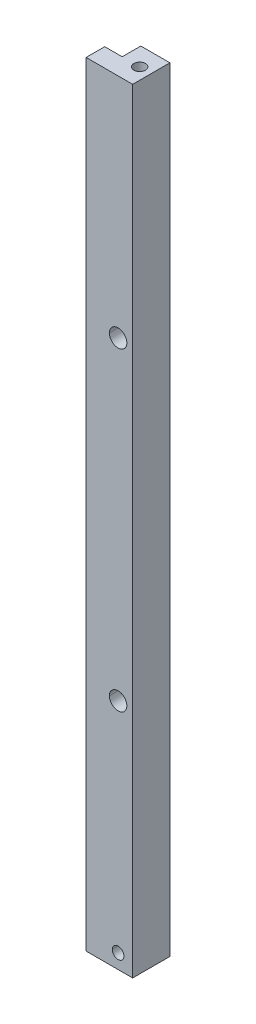
ISO-10303-21;
HEADER;
FILE_DESCRIPTION(('STEP AP214'),'2;1');
FILE_NAME('part.step','',(''),(''),'','','');
FILE_SCHEMA(('AUTOMOTIVE_DESIGN { 1 0 10303 214 1 1 1 1 }'));
ENDSEC;
DATA;
#1=APPLICATION_CONTEXT('core data for automotive mechanical design processes');
#2=APPLICATION_PROTOCOL_DEFINITION('international standard','automotive_design',2000,#1);
#3=PRODUCT_CONTEXT('',#1,'mechanical');
#4=PRODUCT('Part','Part','',(#3));
#5=PRODUCT_RELATED_PRODUCT_CATEGORY('part','',(#4));
#6=PRODUCT_DEFINITION_FORMATION('','',#4);
#7=PRODUCT_DEFINITION_CONTEXT('part definition',#1,'design');
#8=PRODUCT_DEFINITION('design','',#6,#7);
#9=PRODUCT_DEFINITION_SHAPE('','',#8);
#10=(LENGTH_UNIT() NAMED_UNIT(*) SI_UNIT(.MILLI.,.METRE.));
#11=(NAMED_UNIT(*) PLANE_ANGLE_UNIT() SI_UNIT($,.RADIAN.));
#12=(NAMED_UNIT(*) SI_UNIT($,.STERADIAN.) SOLID_ANGLE_UNIT());
#13=UNCERTAINTY_MEASURE_WITH_UNIT(LENGTH_MEASURE(1.E-05),#10,'distance_accuracy_value','');
#14=(GEOMETRIC_REPRESENTATION_CONTEXT(3) GLOBAL_UNCERTAINTY_ASSIGNED_CONTEXT((#13)) GLOBAL_UNIT_ASSIGNED_CONTEXT((#10,
#11,#12)) REPRESENTATION_CONTEXT('',''));
#15=CARTESIAN_POINT('',(0.,0.,0.));
#16=DIRECTION('',(0.,0.,1.));
#17=DIRECTION('',(1.,0.,0.));
#18=AXIS2_PLACEMENT_3D('',#15,#16,#17);
#19=CARTESIAN_POINT('',(0.,0.,0.));
#20=DIRECTION('',(0.,1.,0.));
#21=DIRECTION('',(1.,0.,0.));
#22=AXIS2_PLACEMENT_3D('',#19,#20,#21);
#23=PLANE('',#22);
#24=CARTESIAN_POINT('',(3.,0.,-3.2));
#25=DIRECTION('',(0.,1.,0.));
#26=DIRECTION('',(-1.,0.,0.));
#27=AXIS2_PLACEMENT_3D('',#24,#25,#26);
#28=CIRCLE('',#27,1.);
#29=CARTESIAN_POINT('',(2.,0.,-3.2));
#30=VERTEX_POINT('',#29);
#31=CARTESIAN_POINT('',(4.,0.,-3.2));
#32=VERTEX_POINT('',#31);
#33=EDGE_CURVE('E168',#30,#32,#28,.T.);
#34=ORIENTED_EDGE('',*,*,#33,.F.);
#35=CARTESIAN_POINT('',(3.,0.,-3.2));
#36=DIRECTION('',(0.,1.,0.));
#37=DIRECTION('',(1.,0.,0.));
#38=AXIS2_PLACEMENT_3D('',#35,#36,#37);
#39=CIRCLE('',#38,1.);
#40=EDGE_CURVE('E70',#32,#30,#39,.T.);
#41=ORIENTED_EDGE('',*,*,#40,.F.);
#42=EDGE_LOOP('',(#34,#41));
#43=FACE_BOUND('',#42,.T.);
#44=DIRECTION('',(-1.,0.,0.));
#45=VECTOR('',#44,1.);
#46=CARTESIAN_POINT('',(0.,0.,-3.2));
#47=LINE('',#46,#45);
#48=CARTESIAN_POINT('',(0.,0.,-3.2));
#49=VERTEX_POINT('',#48);
#50=CARTESIAN_POINT('',(-3.,0.,-3.2));
#51=VERTEX_POINT('',#50);
#52=EDGE_CURVE('E12',#49,#51,#47,.T.);
#53=ORIENTED_EDGE('',*,*,#52,.T.);
#54=DIRECTION('',(0.,0.,1.));
#55=VECTOR('',#54,1.);
#56=CARTESIAN_POINT('',(-3.,0.,-3.2));
#57=LINE('',#56,#55);
#58=CARTESIAN_POINT('',(-3.,0.,0.));
#59=VERTEX_POINT('',#58);
#60=EDGE_CURVE('E61',#51,#59,#57,.T.);
#61=ORIENTED_EDGE('',*,*,#60,.T.);
#62=DIRECTION('',(1.,0.,0.));
#63=VECTOR('',#62,1.);
#64=CARTESIAN_POINT('',(-3.,0.,0.));
#65=LINE('',#64,#63);
#66=CARTESIAN_POINT('',(5.,0.,0.));
#67=VERTEX_POINT('',#66);
#68=EDGE_CURVE('E322',#59,#67,#65,.T.);
#69=ORIENTED_EDGE('',*,*,#68,.T.);
#70=DIRECTION('',(0.,0.,-1.));
#71=VECTOR('',#70,1.);
#72=CARTESIAN_POINT('',(5.,0.,0.));
#73=LINE('',#72,#71);
#74=CARTESIAN_POINT('',(5.,0.,-6.4));
#75=VERTEX_POINT('',#74);
#76=EDGE_CURVE('E318',#67,#75,#73,.T.);
#77=ORIENTED_EDGE('',*,*,#76,.T.);
#78=DIRECTION('',(-1.,0.,0.));
#79=VECTOR('',#78,1.);
#80=CARTESIAN_POINT('',(5.,0.,-6.4));
#81=LINE('',#80,#79);
#82=CARTESIAN_POINT('',(0.,0.,-6.4));
#83=VERTEX_POINT('',#82);
#84=EDGE_CURVE('E190',#75,#83,#81,.T.);
#85=ORIENTED_EDGE('',*,*,#84,.T.);
#86=DIRECTION('',(0.,0.,1.));
#87=VECTOR('',#86,1.);
#88=CARTESIAN_POINT('',(0.,0.,-6.4));
#89=LINE('',#88,#87);
#90=EDGE_CURVE('E175',#83,#49,#89,.T.);
#91=ORIENTED_EDGE('',*,*,#90,.T.);
#92=EDGE_LOOP('',(#53,#61,#69,#77,#85,#91));
#93=FACE_BOUND('',#92,.T.);
#94=ADVANCED_FACE('F50',(#43,#93),#23,.T.);
#95=CARTESIAN_POINT('',(3.,-13.2309036499789,-3.2));
#96=DIRECTION('',(0.,-1.,0.));
#97=DIRECTION('',(1.,0.,0.));
#98=AXIS2_PLACEMENT_3D('',#95,#96,#97);
#99=CYLINDRICAL_SURFACE('',#98,1.);
#100=DIRECTION('',(0.,1.,0.));
#101=VECTOR('',#100,1.);
#102=CARTESIAN_POINT('',(4.,-12.,-3.2));
#103=LINE('',#102,#101);
#104=CARTESIAN_POINT('',(4.,-12.,-3.2));
#105=VERTEX_POINT('',#104);
#106=EDGE_CURVE('E151',#105,#32,#103,.T.);
#107=ORIENTED_EDGE('',*,*,#106,.F.);
#108=CARTESIAN_POINT('',(3.,-12.,-3.2));
#109=DIRECTION('',(0.,-1.,0.));
#110=DIRECTION('',(1.,0.,0.));
#111=AXIS2_PLACEMENT_3D('',#108,#109,#110);
#112=CIRCLE('',#111,1.);
#113=CARTESIAN_POINT('',(2.,-12.,-3.2));
#114=VERTEX_POINT('',#113);
#115=EDGE_CURVE('E166',#105,#114,#112,.T.);
#116=ORIENTED_EDGE('',*,*,#115,.T.);
#117=DIRECTION('',(0.,1.,0.));
#118=VECTOR('',#117,1.);
#119=CARTESIAN_POINT('',(2.,-12.,-3.2));
#120=LINE('',#119,#118);
#121=EDGE_CURVE('E153',#114,#30,#120,.T.);
#122=ORIENTED_EDGE('',*,*,#121,.T.);
#123=ORIENTED_EDGE('',*,*,#33,.T.);
#124=EDGE_LOOP('',(#107,#116,#122,#123));
#125=FACE_BOUND('',#124,.T.);
#126=ADVANCED_FACE('F165',(#125),#99,.F.);
#127=CARTESIAN_POINT('',(3.,-13.2309036499789,-3.2));
#128=DIRECTION('',(0.,-1.,0.));
#129=DIRECTION('',(1.,0.,0.));
#130=AXIS2_PLACEMENT_3D('',#127,#128,#129);
#131=CYLINDRICAL_SURFACE('',#130,1.);
#132=ORIENTED_EDGE('',*,*,#121,.F.);
#133=CARTESIAN_POINT('',(3.,-12.,-3.2));
#134=DIRECTION('',(0.,1.,0.));
#135=DIRECTION('',(1.,0.,0.));
#136=AXIS2_PLACEMENT_3D('',#133,#134,#135);
#137=CIRCLE('',#136,1.);
#138=EDGE_CURVE('E148',#105,#114,#137,.T.);
#139=ORIENTED_EDGE('',*,*,#138,.F.);
#140=ORIENTED_EDGE('',*,*,#106,.T.);
#141=ORIENTED_EDGE('',*,*,#40,.T.);
#142=EDGE_LOOP('',(#132,#139,#140,#141));
#143=FACE_BOUND('',#142,.T.);
#144=ADVANCED_FACE('F150',(#143),#131,.F.);
#145=CARTESIAN_POINT('',(0.,0.,-3.2));
#146=DIRECTION('',(0.,0.,-1.));
#147=DIRECTION('',(-1.,0.,0.));
#148=AXIS2_PLACEMENT_3D('',#145,#146,#147);
#149=PLANE('',#148);
#150=DIRECTION('',(0.,-1.,0.));
#151=VECTOR('',#150,1.);
#152=CARTESIAN_POINT('',(0.,0.,-3.2));
#153=LINE('',#152,#151);
#154=CARTESIAN_POINT('',(0.,-133.,-3.2));
#155=VERTEX_POINT('',#154);
#156=EDGE_CURVE('E202',#49,#155,#153,.T.);
#157=ORIENTED_EDGE('',*,*,#156,.T.);
#158=DIRECTION('',(-1.,0.,0.));
#159=VECTOR('',#158,1.);
#160=CARTESIAN_POINT('',(0.,-133.,-3.2));
#161=LINE('',#160,#159);
#162=CARTESIAN_POINT('',(-3.,-133.,-3.2));
#163=VERTEX_POINT('',#162);
#164=EDGE_CURVE('E221',#155,#163,#161,.T.);
#165=ORIENTED_EDGE('',*,*,#164,.T.);
#166=DIRECTION('',(0.,-1.,0.));
#167=VECTOR('',#166,1.);
#168=CARTESIAN_POINT('',(-3.,0.,-3.2));
#169=LINE('',#168,#167);
#170=EDGE_CURVE('E208',#51,#163,#169,.T.);
#171=ORIENTED_EDGE('',*,*,#170,.F.);
#172=ORIENTED_EDGE('',*,*,#52,.F.);
#173=EDGE_LOOP('',(#157,#165,#171,#172));
#174=FACE_BOUND('',#173,.T.);
#175=ADVANCED_FACE('F276',(#174),#149,.T.);
#176=CARTESIAN_POINT('',(-3.,0.,-3.2));
#177=DIRECTION('',(-1.,0.,0.));
#178=DIRECTION('',(0.,0.,1.));
#179=AXIS2_PLACEMENT_3D('',#176,#177,#178);
#180=PLANE('',#179);
#181=ORIENTED_EDGE('',*,*,#170,.T.);
#182=DIRECTION('',(0.,0.,1.));
#183=VECTOR('',#182,1.);
#184=CARTESIAN_POINT('',(-3.,-133.,-3.2));
#185=LINE('',#184,#183);
#186=CARTESIAN_POINT('',(-3.,-133.,0.));
#187=VERTEX_POINT('',#186);
#188=EDGE_CURVE('E204',#163,#187,#185,.T.);
#189=ORIENTED_EDGE('',*,*,#188,.T.);
#190=DIRECTION('',(0.,-1.,0.));
#191=VECTOR('',#190,1.);
#192=CARTESIAN_POINT('',(-3.,0.,0.));
#193=LINE('',#192,#191);
#194=EDGE_CURVE('E209',#59,#187,#193,.T.);
#195=ORIENTED_EDGE('',*,*,#194,.F.);
#196=ORIENTED_EDGE('',*,*,#60,.F.);
#197=EDGE_LOOP('',(#181,#189,#195,#196));
#198=FACE_BOUND('',#197,.T.);
#199=ADVANCED_FACE('F352',(#198),#180,.T.);
#200=CARTESIAN_POINT('',(-3.,0.,0.));
#201=DIRECTION('',(0.,0.,1.));
#202=DIRECTION('',(1.,0.,0.));
#203=AXIS2_PLACEMENT_3D('',#200,#201,#202);
#204=PLANE('',#203);
#205=CARTESIAN_POINT('',(2.5,-39.,0.));
#206=DIRECTION('',(0.,0.,1.));
#207=DIRECTION('',(-1.,0.,0.));
#208=AXIS2_PLACEMENT_3D('',#205,#206,#207);
#209=CIRCLE('',#208,1.5);
#210=CARTESIAN_POINT('',(1.,-39.,0.));
#211=VERTEX_POINT('',#210);
#212=CARTESIAN_POINT('',(4.,-39.,0.));
#213=VERTEX_POINT('',#212);
#214=EDGE_CURVE('E212',#211,#213,#209,.T.);
#215=ORIENTED_EDGE('',*,*,#214,.F.);
#216=CARTESIAN_POINT('',(2.5,-39.,0.));
#217=DIRECTION('',(0.,0.,1.));
#218=DIRECTION('',(1.,0.,0.));
#219=AXIS2_PLACEMENT_3D('',#216,#217,#218);
#220=CIRCLE('',#219,1.5);
#221=EDGE_CURVE('E226',#213,#211,#220,.T.);
#222=ORIENTED_EDGE('',*,*,#221,.F.);
#223=EDGE_LOOP('',(#215,#222));
#224=FACE_BOUND('',#223,.T.);
#225=CARTESIAN_POINT('',(2.5,-93.,0.));
#226=DIRECTION('',(0.,0.,1.));
#227=DIRECTION('',(-1.,0.,0.));
#228=AXIS2_PLACEMENT_3D('',#225,#226,#227);
#229=CIRCLE('',#228,1.5);
#230=CARTESIAN_POINT('',(1.,-93.,0.));
#231=VERTEX_POINT('',#230);
#232=CARTESIAN_POINT('',(4.,-93.,0.));
#233=VERTEX_POINT('',#232);
#234=EDGE_CURVE('E227',#231,#233,#229,.T.);
#235=ORIENTED_EDGE('',*,*,#234,.F.);
#236=CARTESIAN_POINT('',(2.5,-93.,0.));
#237=DIRECTION('',(0.,0.,1.));
#238=DIRECTION('',(1.,0.,0.));
#239=AXIS2_PLACEMENT_3D('',#236,#237,#238);
#240=CIRCLE('',#239,1.5);
#241=EDGE_CURVE('E192',#233,#231,#240,.T.);
#242=ORIENTED_EDGE('',*,*,#241,.F.);
#243=EDGE_LOOP('',(#235,#242));
#244=FACE_BOUND('',#243,.T.);
#245=ORIENTED_EDGE('',*,*,#194,.T.);
#246=DIRECTION('',(-1.,0.,0.));
#247=VECTOR('',#246,1.);
#248=CARTESIAN_POINT('',(5.,-133.,0.));
#249=LINE('',#248,#247);
#250=CARTESIAN_POINT('',(5.,-133.,0.));
#251=VERTEX_POINT('',#250);
#252=EDGE_CURVE('E179',#251,#187,#249,.T.);
#253=ORIENTED_EDGE('',*,*,#252,.F.);
#254=DIRECTION('',(0.,-1.,0.));
#255=VECTOR('',#254,1.);
#256=CARTESIAN_POINT('',(5.,0.,0.));
#257=LINE('',#256,#255);
#258=EDGE_CURVE('E231',#67,#251,#257,.T.);
#259=ORIENTED_EDGE('',*,*,#258,.F.);
#260=ORIENTED_EDGE('',*,*,#68,.F.);
#261=EDGE_LOOP('',(#245,#253,#259,#260));
#262=FACE_BOUND('',#261,.T.);
#263=CARTESIAN_POINT('',(2.5,-130.5,0.));
#264=DIRECTION('',(0.,0.,1.));
#265=DIRECTION('',(-1.,0.,0.));
#266=AXIS2_PLACEMENT_3D('',#263,#264,#265);
#267=CIRCLE('',#266,1.);
#268=CARTESIAN_POINT('',(1.5,-130.5,0.));
#269=VERTEX_POINT('',#268);
#270=CARTESIAN_POINT('',(3.5,-130.5,0.));
#271=VERTEX_POINT('',#270);
#272=EDGE_CURVE('E301',#269,#271,#267,.T.);
#273=ORIENTED_EDGE('',*,*,#272,.F.);
#274=CARTESIAN_POINT('',(2.5,-130.5,0.));
#275=DIRECTION('',(0.,0.,1.));
#276=DIRECTION('',(1.,0.,0.));
#277=AXIS2_PLACEMENT_3D('',#274,#275,#276);
#278=CIRCLE('',#277,1.);
#279=EDGE_CURVE('E196',#271,#269,#278,.T.);
#280=ORIENTED_EDGE('',*,*,#279,.F.);
#281=EDGE_LOOP('',(#273,#280));
#282=FACE_BOUND('',#281,.T.);
#283=ADVANCED_FACE('F348',(#224,#244,#262,#282),#204,.T.);
#284=CARTESIAN_POINT('',(5.,0.,0.));
#285=DIRECTION('',(1.,0.,0.));
#286=DIRECTION('',(0.,0.,-1.));
#287=AXIS2_PLACEMENT_3D('',#284,#285,#286);
#288=PLANE('',#287);
#289=ORIENTED_EDGE('',*,*,#258,.T.);
#290=DIRECTION('',(0.,0.,-1.));
#291=VECTOR('',#290,1.);
#292=CARTESIAN_POINT('',(5.,-133.,0.));
#293=LINE('',#292,#291);
#294=CARTESIAN_POINT('',(5.,-133.,-6.4));
#295=VERTEX_POINT('',#294);
#296=EDGE_CURVE('E228',#251,#295,#293,.T.);
#297=ORIENTED_EDGE('',*,*,#296,.T.);
#298=DIRECTION('',(0.,-1.,0.));
#299=VECTOR('',#298,1.);
#300=CARTESIAN_POINT('',(5.,0.,-6.4));
#301=LINE('',#300,#299);
#302=EDGE_CURVE('E247',#75,#295,#301,.T.);
#303=ORIENTED_EDGE('',*,*,#302,.F.);
#304=ORIENTED_EDGE('',*,*,#76,.F.);
#305=EDGE_LOOP('',(#289,#297,#303,#304));
#306=FACE_BOUND('',#305,.T.);
#307=ADVANCED_FACE('F351',(#306),#288,.T.);
#308=CARTESIAN_POINT('',(5.,0.,-6.4));
#309=DIRECTION('',(0.,0.,-1.));
#310=DIRECTION('',(-1.,0.,0.));
#311=AXIS2_PLACEMENT_3D('',#308,#309,#310);
#312=PLANE('',#311);
#313=CARTESIAN_POINT('',(2.5,-39.,-6.4));
#314=DIRECTION('',(0.,0.,1.));
#315=DIRECTION('',(-1.,0.,0.));
#316=AXIS2_PLACEMENT_3D('',#313,#314,#315);
#317=CIRCLE('',#316,1.5);
#318=CARTESIAN_POINT('',(1.,-39.,-6.4));
#319=VERTEX_POINT('',#318);
#320=CARTESIAN_POINT('',(4.,-39.,-6.4));
#321=VERTEX_POINT('',#320);
#322=EDGE_CURVE('E232',#319,#321,#317,.T.);
#323=ORIENTED_EDGE('',*,*,#322,.T.);
#324=CARTESIAN_POINT('',(2.5,-39.,-6.4));
#325=DIRECTION('',(0.,0.,1.));
#326=DIRECTION('',(1.,0.,0.));
#327=AXIS2_PLACEMENT_3D('',#324,#325,#326);
#328=CIRCLE('',#327,1.5);
#329=EDGE_CURVE('E241',#321,#319,#328,.T.);
#330=ORIENTED_EDGE('',*,*,#329,.T.);
#331=EDGE_LOOP('',(#323,#330));
#332=FACE_BOUND('',#331,.T.);
#333=CARTESIAN_POINT('',(2.5,-93.,-6.4));
#334=DIRECTION('',(0.,0.,1.));
#335=DIRECTION('',(-1.,0.,0.));
#336=AXIS2_PLACEMENT_3D('',#333,#334,#335);
#337=CIRCLE('',#336,1.5);
#338=CARTESIAN_POINT('',(1.,-93.,-6.4));
#339=VERTEX_POINT('',#338);
#340=CARTESIAN_POINT('',(4.,-93.,-6.4));
#341=VERTEX_POINT('',#340);
#342=EDGE_CURVE('E237',#339,#341,#337,.T.);
#343=ORIENTED_EDGE('',*,*,#342,.T.);
#344=CARTESIAN_POINT('',(2.5,-93.,-6.4));
#345=DIRECTION('',(0.,0.,1.));
#346=DIRECTION('',(1.,0.,0.));
#347=AXIS2_PLACEMENT_3D('',#344,#345,#346);
#348=CIRCLE('',#347,1.5);
#349=EDGE_CURVE('E242',#341,#339,#348,.T.);
#350=ORIENTED_EDGE('',*,*,#349,.T.);
#351=EDGE_LOOP('',(#343,#350));
#352=FACE_BOUND('',#351,.T.);
#353=CARTESIAN_POINT('',(2.5,-130.5,-6.4));
#354=DIRECTION('',(0.,0.,1.));
#355=DIRECTION('',(-1.,0.,0.));
#356=AXIS2_PLACEMENT_3D('',#353,#354,#355);
#357=CIRCLE('',#356,1.);
#358=CARTESIAN_POINT('',(1.5,-130.5,-6.4));
#359=VERTEX_POINT('',#358);
#360=CARTESIAN_POINT('',(3.5,-130.5,-6.4));
#361=VERTEX_POINT('',#360);
#362=EDGE_CURVE('E246',#359,#361,#357,.T.);
#363=ORIENTED_EDGE('',*,*,#362,.T.);
#364=CARTESIAN_POINT('',(2.5,-130.5,-6.4));
#365=DIRECTION('',(0.,0.,1.));
#366=DIRECTION('',(1.,0.,0.));
#367=AXIS2_PLACEMENT_3D('',#364,#365,#366);
#368=CIRCLE('',#367,1.);
#369=EDGE_CURVE('E243',#361,#359,#368,.T.);
#370=ORIENTED_EDGE('',*,*,#369,.T.);
#371=EDGE_LOOP('',(#363,#370));
#372=FACE_BOUND('',#371,.T.);
#373=ORIENTED_EDGE('',*,*,#302,.T.);
#374=DIRECTION('',(-1.,0.,0.));
#375=VECTOR('',#374,1.);
#376=CARTESIAN_POINT('',(5.,-133.,-6.4));
#377=LINE('',#376,#375);
#378=CARTESIAN_POINT('',(0.,-133.,-6.4));
#379=VERTEX_POINT('',#378);
#380=EDGE_CURVE('E256',#295,#379,#377,.T.);
#381=ORIENTED_EDGE('',*,*,#380,.T.);
#382=DIRECTION('',(0.,-1.,0.));
#383=VECTOR('',#382,1.);
#384=CARTESIAN_POINT('',(0.,0.,-6.4));
#385=LINE('',#384,#383);
#386=EDGE_CURVE('E218',#83,#379,#385,.T.);
#387=ORIENTED_EDGE('',*,*,#386,.F.);
#388=ORIENTED_EDGE('',*,*,#84,.F.);
#389=EDGE_LOOP('',(#373,#381,#387,#388));
#390=FACE_BOUND('',#389,.T.);
#391=ADVANCED_FACE('F289',(#332,#352,#372,#390),#312,.T.);
#392=CARTESIAN_POINT('',(0.,0.,-6.4));
#393=DIRECTION('',(-1.,0.,0.));
#394=DIRECTION('',(0.,0.,1.));
#395=AXIS2_PLACEMENT_3D('',#392,#393,#394);
#396=PLANE('',#395);
#397=DIRECTION('',(0.,0.,1.));
#398=VECTOR('',#397,1.);
#399=CARTESIAN_POINT('',(0.,-133.,-6.4));
#400=LINE('',#399,#398);
#401=EDGE_CURVE('E213',#379,#155,#400,.T.);
#402=ORIENTED_EDGE('',*,*,#401,.T.);
#403=ORIENTED_EDGE('',*,*,#156,.F.);
#404=ORIENTED_EDGE('',*,*,#90,.F.);
#405=ORIENTED_EDGE('',*,*,#386,.T.);
#406=EDGE_LOOP('',(#402,#403,#404,#405));
#407=FACE_BOUND('',#406,.T.);
#408=ADVANCED_FACE('F284',(#407),#396,.T.);
#409=CARTESIAN_POINT('',(3.,-12.,-3.2));
#410=DIRECTION('',(0.,1.,0.));
#411=DIRECTION('',(1.,0.,0.));
#412=AXIS2_PLACEMENT_3D('',#409,#410,#411);
#413=CONICAL_SURFACE('',#412,1.,1.02974425867665);
#414=DIRECTION('',(-0.857167300702112,0.515038074910055,0.));
#415=VECTOR('',#414,1.);
#416=CARTESIAN_POINT('',(3.,-12.6008606190276,-3.2));
#417=LINE('',#416,#415);
#418=CARTESIAN_POINT('',(3.,-12.6008606190276,-3.2));
#419=VERTEX_POINT('',#418);
#420=EDGE_CURVE('E159',#419,#114,#417,.T.);
#421=ORIENTED_EDGE('',*,*,#420,.T.);
#422=ORIENTED_EDGE('',*,*,#115,.F.);
#423=DIRECTION('',(0.857167300702112,0.515038074910055,0.));
#424=VECTOR('',#423,1.);
#425=CARTESIAN_POINT('',(3.,-12.6008606190276,-3.2));
#426=LINE('',#425,#424);
#427=EDGE_CURVE('E160',#419,#105,#426,.T.);
#428=ORIENTED_EDGE('',*,*,#427,.F.);
#429=EDGE_LOOP('',(#421,#422,#428));
#430=FACE_BOUND('',#429,.T.);
#431=ADVANCED_FACE('F173',(#430),#413,.F.);
#432=CARTESIAN_POINT('',(3.,-12.,-3.2));
#433=DIRECTION('',(0.,1.,0.));
#434=DIRECTION('',(1.,0.,0.));
#435=AXIS2_PLACEMENT_3D('',#432,#433,#434);
#436=CONICAL_SURFACE('',#435,1.,1.02974425867665);
#437=ORIENTED_EDGE('',*,*,#138,.T.);
#438=ORIENTED_EDGE('',*,*,#420,.F.);
#439=ORIENTED_EDGE('',*,*,#427,.T.);
#440=EDGE_LOOP('',(#437,#438,#439));
#441=FACE_BOUND('',#440,.T.);
#442=ADVANCED_FACE('F177',(#441),#436,.F.);
#443=CARTESIAN_POINT('',(0.,-133.,0.));
#444=DIRECTION('',(0.,1.,0.));
#445=DIRECTION('',(1.,0.,0.));
#446=AXIS2_PLACEMENT_3D('',#443,#444,#445);
#447=PLANE('',#446);
#448=ORIENTED_EDGE('',*,*,#380,.F.);
#449=ORIENTED_EDGE('',*,*,#296,.F.);
#450=ORIENTED_EDGE('',*,*,#252,.T.);
#451=ORIENTED_EDGE('',*,*,#188,.F.);
#452=ORIENTED_EDGE('',*,*,#164,.F.);
#453=ORIENTED_EDGE('',*,*,#401,.F.);
#454=EDGE_LOOP('',(#448,#449,#450,#451,#452,#453));
#455=FACE_BOUND('',#454,.T.);
#456=ADVANCED_FACE('F283',(#455),#447,.F.);
#457=CARTESIAN_POINT('',(2.5,-39.,-6.4));
#458=DIRECTION('',(0.,0.,-1.));
#459=DIRECTION('',(1.,0.,0.));
#460=AXIS2_PLACEMENT_3D('',#457,#458,#459);
#461=CYLINDRICAL_SURFACE('',#460,1.5);
#462=DIRECTION('',(0.,0.,1.));
#463=VECTOR('',#462,1.);
#464=CARTESIAN_POINT('',(4.,-39.,-6.4));
#465=LINE('',#464,#463);
#466=EDGE_CURVE('E54',#321,#213,#465,.T.);
#467=ORIENTED_EDGE('',*,*,#466,.F.);
#468=ORIENTED_EDGE('',*,*,#322,.F.);
#469=DIRECTION('',(0.,0.,1.));
#470=VECTOR('',#469,1.);
#471=CARTESIAN_POINT('',(1.,-39.,-6.4));
#472=LINE('',#471,#470);
#473=EDGE_CURVE('E186',#319,#211,#472,.T.);
#474=ORIENTED_EDGE('',*,*,#473,.T.);
#475=ORIENTED_EDGE('',*,*,#214,.T.);
#476=EDGE_LOOP('',(#467,#468,#474,#475));
#477=FACE_BOUND('',#476,.T.);
#478=ADVANCED_FACE('F379',(#477),#461,.F.);
#479=CARTESIAN_POINT('',(2.5,-39.,-6.4));
#480=DIRECTION('',(0.,0.,-1.));
#481=DIRECTION('',(1.,0.,0.));
#482=AXIS2_PLACEMENT_3D('',#479,#480,#481);
#483=CYLINDRICAL_SURFACE('',#482,1.5);
#484=ORIENTED_EDGE('',*,*,#473,.F.);
#485=ORIENTED_EDGE('',*,*,#329,.F.);
#486=ORIENTED_EDGE('',*,*,#466,.T.);
#487=ORIENTED_EDGE('',*,*,#221,.T.);
#488=EDGE_LOOP('',(#484,#485,#486,#487));
#489=FACE_BOUND('',#488,.T.);
#490=ADVANCED_FACE('F377',(#489),#483,.F.);
#491=CARTESIAN_POINT('',(2.5,-93.,-6.4));
#492=DIRECTION('',(0.,0.,-1.));
#493=DIRECTION('',(1.,0.,0.));
#494=AXIS2_PLACEMENT_3D('',#491,#492,#493);
#495=CYLINDRICAL_SURFACE('',#494,1.5);
#496=DIRECTION('',(0.,0.,1.));
#497=VECTOR('',#496,1.);
#498=CARTESIAN_POINT('',(4.,-93.,-6.4));
#499=LINE('',#498,#497);
#500=EDGE_CURVE('E194',#341,#233,#499,.T.);
#501=ORIENTED_EDGE('',*,*,#500,.F.);
#502=ORIENTED_EDGE('',*,*,#342,.F.);
#503=DIRECTION('',(0.,0.,1.));
#504=VECTOR('',#503,1.);
#505=CARTESIAN_POINT('',(1.,-93.,-6.4));
#506=LINE('',#505,#504);
#507=EDGE_CURVE('E222',#339,#231,#506,.T.);
#508=ORIENTED_EDGE('',*,*,#507,.T.);
#509=ORIENTED_EDGE('',*,*,#234,.T.);
#510=EDGE_LOOP('',(#501,#502,#508,#509));
#511=FACE_BOUND('',#510,.T.);
#512=ADVANCED_FACE('F344',(#511),#495,.F.);
#513=CARTESIAN_POINT('',(2.5,-93.,-6.4));
#514=DIRECTION('',(0.,0.,-1.));
#515=DIRECTION('',(1.,0.,0.));
#516=AXIS2_PLACEMENT_3D('',#513,#514,#515);
#517=CYLINDRICAL_SURFACE('',#516,1.5);
#518=ORIENTED_EDGE('',*,*,#507,.F.);
#519=ORIENTED_EDGE('',*,*,#349,.F.);
#520=ORIENTED_EDGE('',*,*,#500,.T.);
#521=ORIENTED_EDGE('',*,*,#241,.T.);
#522=EDGE_LOOP('',(#518,#519,#520,#521));
#523=FACE_BOUND('',#522,.T.);
#524=ADVANCED_FACE('F345',(#523),#517,.F.);
#525=CARTESIAN_POINT('',(2.5,-130.5,-6.4));
#526=DIRECTION('',(0.,0.,-1.));
#527=DIRECTION('',(1.,0.,0.));
#528=AXIS2_PLACEMENT_3D('',#525,#526,#527);
#529=CYLINDRICAL_SURFACE('',#528,1.);
#530=DIRECTION('',(0.,0.,1.));
#531=VECTOR('',#530,1.);
#532=CARTESIAN_POINT('',(3.5,-130.5,-6.4));
#533=LINE('',#532,#531);
#534=EDGE_CURVE('E200',#361,#271,#533,.T.);
#535=ORIENTED_EDGE('',*,*,#534,.F.);
#536=ORIENTED_EDGE('',*,*,#362,.F.);
#537=DIRECTION('',(0.,0.,1.));
#538=VECTOR('',#537,1.);
#539=CARTESIAN_POINT('',(1.5,-130.5,-6.4));
#540=LINE('',#539,#538);
#541=EDGE_CURVE('E195',#359,#269,#540,.T.);
#542=ORIENTED_EDGE('',*,*,#541,.T.);
#543=ORIENTED_EDGE('',*,*,#272,.T.);
#544=EDGE_LOOP('',(#535,#536,#542,#543));
#545=FACE_BOUND('',#544,.T.);
#546=ADVANCED_FACE('F52',(#545),#529,.F.);
#547=CARTESIAN_POINT('',(2.5,-130.5,-6.4));
#548=DIRECTION('',(0.,0.,-1.));
#549=DIRECTION('',(1.,0.,0.));
#550=AXIS2_PLACEMENT_3D('',#547,#548,#549);
#551=CYLINDRICAL_SURFACE('',#550,1.);
#552=ORIENTED_EDGE('',*,*,#541,.F.);
#553=ORIENTED_EDGE('',*,*,#369,.F.);
#554=ORIENTED_EDGE('',*,*,#534,.T.);
#555=ORIENTED_EDGE('',*,*,#279,.T.);
#556=EDGE_LOOP('',(#552,#553,#554,#555));
#557=FACE_BOUND('',#556,.T.);
#558=ADVANCED_FACE('F364',(#557),#551,.F.);
#559=CLOSED_SHELL('',(#94,#126,#144,#175,#199,#283,#307,#391,#408,#431,#442,#456,#478,#490,#512,
#524,#546,#558));
#560=MANIFOLD_SOLID_BREP('B2',#559);
#561=ADVANCED_BREP_SHAPE_REPRESENTATION('',(#18,#560),#14);
#562=SHAPE_DEFINITION_REPRESENTATION(#9,#561);
ENDSEC;
END-ISO-10303-21;
